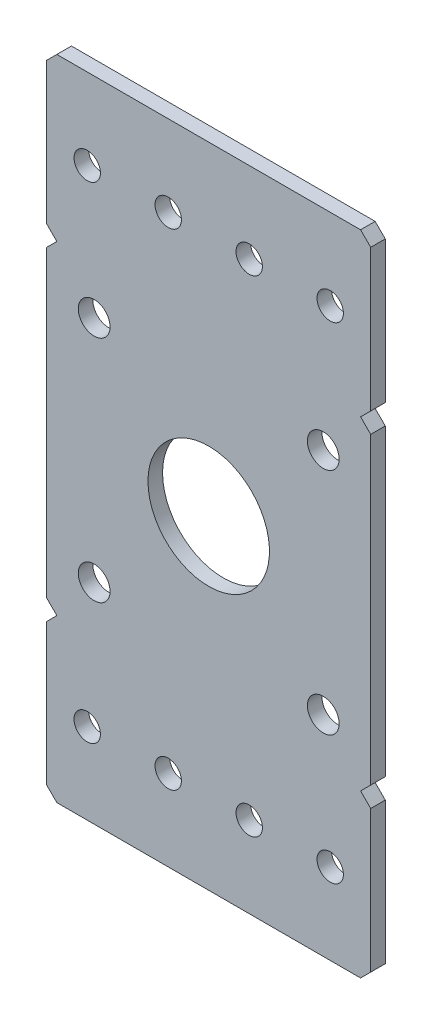
ISO-10303-21;
HEADER;
FILE_DESCRIPTION(('STEP AP214'),'2;1');
FILE_NAME('part.step','',(''),(''),'','','');
FILE_SCHEMA(('AUTOMOTIVE_DESIGN { 1 0 10303 214 1 1 1 1 }'));
ENDSEC;
DATA;
#1=APPLICATION_CONTEXT('core data for automotive mechanical design processes');
#2=APPLICATION_PROTOCOL_DEFINITION('international standard','automotive_design',2000,#1);
#3=PRODUCT_CONTEXT('',#1,'mechanical');
#4=PRODUCT('Part','Part','',(#3));
#5=PRODUCT_RELATED_PRODUCT_CATEGORY('part','',(#4));
#6=PRODUCT_DEFINITION_FORMATION('','',#4);
#7=PRODUCT_DEFINITION_CONTEXT('part definition',#1,'design');
#8=PRODUCT_DEFINITION('design','',#6,#7);
#9=PRODUCT_DEFINITION_SHAPE('','',#8);
#10=(LENGTH_UNIT() NAMED_UNIT(*) SI_UNIT(.MILLI.,.METRE.));
#11=(NAMED_UNIT(*) PLANE_ANGLE_UNIT() SI_UNIT($,.RADIAN.));
#12=(NAMED_UNIT(*) SI_UNIT($,.STERADIAN.) SOLID_ANGLE_UNIT());
#13=UNCERTAINTY_MEASURE_WITH_UNIT(LENGTH_MEASURE(1.E-05),#10,'distance_accuracy_value','');
#14=(GEOMETRIC_REPRESENTATION_CONTEXT(3) GLOBAL_UNCERTAINTY_ASSIGNED_CONTEXT((#13)) GLOBAL_UNIT_ASSIGNED_CONTEXT((#10,
#11,#12)) REPRESENTATION_CONTEXT('',''));
#15=CARTESIAN_POINT('',(0.,0.,0.));
#16=DIRECTION('',(0.,0.,1.));
#17=DIRECTION('',(1.,0.,0.));
#18=AXIS2_PLACEMENT_3D('',#15,#16,#17);
#19=CARTESIAN_POINT('',(25.4,50.8,2.286));
#20=DIRECTION('',(0.,0.,-1.));
#21=DIRECTION('',(-1.,0.,0.));
#22=AXIS2_PLACEMENT_3D('',#19,#20,#21);
#23=PLANE('',#22);
#24=CARTESIAN_POINT('',(-17.9605122421383,-17.9605122421383,2.286));
#25=DIRECTION('',(0.,0.,-1.));
#26=DIRECTION('',(-1.,0.,0.));
#27=AXIS2_PLACEMENT_3D('',#24,#25,#26);
#28=CIRCLE('',#27,2.4892);
#29=CARTESIAN_POINT('',(-20.4497122421383,-17.9605122421383,2.286));
#30=VERTEX_POINT('',#29);
#31=EDGE_CURVE('E216',#30,#30,#28,.T.);
#32=ORIENTED_EDGE('',*,*,#31,.T.);
#33=EDGE_LOOP('',(#32));
#34=FACE_BOUND('',#33,.T.);
#35=CARTESIAN_POINT('',(-19.05,-38.1,2.286));
#36=DIRECTION('',(0.,0.,-1.));
#37=DIRECTION('',(-1.,0.,0.));
#38=AXIS2_PLACEMENT_3D('',#35,#36,#37);
#39=CIRCLE('',#38,2.0701);
#40=CARTESIAN_POINT('',(-21.1201,-38.1,2.286));
#41=VERTEX_POINT('',#40);
#42=EDGE_CURVE('E220',#41,#41,#39,.T.);
#43=ORIENTED_EDGE('',*,*,#42,.T.);
#44=EDGE_LOOP('',(#43));
#45=FACE_BOUND('',#44,.T.);
#46=CARTESIAN_POINT('',(-6.35000000000001,-38.1,2.286));
#47=DIRECTION('',(0.,0.,-1.));
#48=DIRECTION('',(-1.,0.,0.));
#49=AXIS2_PLACEMENT_3D('',#46,#47,#48);
#50=CIRCLE('',#49,2.07009999999999);
#51=CARTESIAN_POINT('',(-8.4201,-38.1,2.286));
#52=VERTEX_POINT('',#51);
#53=EDGE_CURVE('E223',#52,#52,#50,.T.);
#54=ORIENTED_EDGE('',*,*,#53,.T.);
#55=EDGE_LOOP('',(#54));
#56=FACE_BOUND('',#55,.T.);
#57=CARTESIAN_POINT('',(19.05,-38.1,2.286));
#58=DIRECTION('',(0.,0.,-1.));
#59=DIRECTION('',(-1.,0.,0.));
#60=AXIS2_PLACEMENT_3D('',#57,#58,#59);
#61=CIRCLE('',#60,2.07009999999999);
#62=CARTESIAN_POINT('',(16.9799,-38.1,2.286));
#63=VERTEX_POINT('',#62);
#64=EDGE_CURVE('E226',#63,#63,#61,.T.);
#65=ORIENTED_EDGE('',*,*,#64,.T.);
#66=EDGE_LOOP('',(#65));
#67=FACE_BOUND('',#66,.T.);
#68=CARTESIAN_POINT('',(0.,0.,2.286));
#69=DIRECTION('',(0.,0.,-1.));
#70=DIRECTION('',(-1.,0.,0.));
#71=AXIS2_PLACEMENT_3D('',#68,#69,#70);
#72=CIRCLE('',#71,9.525);
#73=CARTESIAN_POINT('',(-9.525,0.,2.286));
#74=VERTEX_POINT('',#73);
#75=EDGE_CURVE('E229',#74,#74,#72,.T.);
#76=ORIENTED_EDGE('',*,*,#75,.T.);
#77=EDGE_LOOP('',(#76));
#78=FACE_BOUND('',#77,.T.);
#79=CARTESIAN_POINT('',(6.34999999999999,38.1,2.286));
#80=DIRECTION('',(0.,0.,-1.));
#81=DIRECTION('',(-1.,0.,0.));
#82=AXIS2_PLACEMENT_3D('',#79,#80,#81);
#83=CIRCLE('',#82,2.07009999999999);
#84=CARTESIAN_POINT('',(4.2799,38.1,2.286));
#85=VERTEX_POINT('',#84);
#86=EDGE_CURVE('E232',#85,#85,#83,.T.);
#87=ORIENTED_EDGE('',*,*,#86,.T.);
#88=EDGE_LOOP('',(#87));
#89=FACE_BOUND('',#88,.T.);
#90=CARTESIAN_POINT('',(-19.05,38.1,2.286));
#91=DIRECTION('',(0.,0.,-1.));
#92=DIRECTION('',(-1.,0.,0.));
#93=AXIS2_PLACEMENT_3D('',#90,#91,#92);
#94=CIRCLE('',#93,2.0701);
#95=CARTESIAN_POINT('',(-21.1201,38.1,2.286));
#96=VERTEX_POINT('',#95);
#97=EDGE_CURVE('E235',#96,#96,#94,.T.);
#98=ORIENTED_EDGE('',*,*,#97,.T.);
#99=EDGE_LOOP('',(#98));
#100=FACE_BOUND('',#99,.T.);
#101=DIRECTION('',(0.707106781186543,-0.707106781186552,0.));
#102=VECTOR('',#101,1.);
#103=CARTESIAN_POINT('',(23.8125,-25.4,2.286));
#104=LINE('',#103,#102);
#105=CARTESIAN_POINT('',(25.4,-26.9875,2.286));
#106=VERTEX_POINT('',#105);
#107=CARTESIAN_POINT('',(23.8125,-25.4,2.286));
#108=VERTEX_POINT('',#107);
#109=EDGE_CURVE('E157',#106,#108,#104,.F.);
#110=ORIENTED_EDGE('',*,*,#109,.T.);
#111=DIRECTION('',(-0.707106781186555,-0.707106781186541,0.));
#112=VECTOR('',#111,1.);
#113=CARTESIAN_POINT('',(25.4,-23.8125,2.286));
#114=LINE('',#113,#112);
#115=CARTESIAN_POINT('',(25.4,-23.8125,2.286));
#116=VERTEX_POINT('',#115);
#117=EDGE_CURVE('E254',#108,#116,#114,.F.);
#118=ORIENTED_EDGE('',*,*,#117,.T.);
#119=DIRECTION('',(0.,1.,0.));
#120=VECTOR('',#119,1.);
#121=CARTESIAN_POINT('',(25.4,25.4,2.286));
#122=LINE('',#121,#120);
#123=CARTESIAN_POINT('',(25.4,23.8125,2.286));
#124=VERTEX_POINT('',#123);
#125=EDGE_CURVE('E264',#116,#124,#122,.T.);
#126=ORIENTED_EDGE('',*,*,#125,.T.);
#127=DIRECTION('',(0.707106781186549,-0.707106781186546,0.));
#128=VECTOR('',#127,1.);
#129=CARTESIAN_POINT('',(23.8125,25.4,2.286));
#130=LINE('',#129,#128);
#131=CARTESIAN_POINT('',(23.8125,25.4,2.286));
#132=VERTEX_POINT('',#131);
#133=EDGE_CURVE('E268',#124,#132,#130,.F.);
#134=ORIENTED_EDGE('',*,*,#133,.T.);
#135=DIRECTION('',(-0.707106781186543,-0.707106781186552,0.));
#136=VECTOR('',#135,1.);
#137=CARTESIAN_POINT('',(25.4,26.9875,2.286));
#138=LINE('',#137,#136);
#139=CARTESIAN_POINT('',(25.4,26.9875,2.286));
#140=VERTEX_POINT('',#139);
#141=EDGE_CURVE('E273',#132,#140,#138,.F.);
#142=ORIENTED_EDGE('',*,*,#141,.T.);
#143=DIRECTION('',(0.,1.,0.));
#144=VECTOR('',#143,1.);
#145=CARTESIAN_POINT('',(25.4,25.4,2.286));
#146=LINE('',#145,#144);
#147=CARTESIAN_POINT('',(25.4,49.2125,2.286));
#148=VERTEX_POINT('',#147);
#149=EDGE_CURVE('E278',#140,#148,#146,.T.);
#150=ORIENTED_EDGE('',*,*,#149,.T.);
#151=DIRECTION('',(0.707106781186548,-0.707106781186547,0.));
#152=VECTOR('',#151,1.);
#153=CARTESIAN_POINT('',(23.8125,50.8,2.286));
#154=LINE('',#153,#152);
#155=CARTESIAN_POINT('',(23.8125,50.8,2.286));
#156=VERTEX_POINT('',#155);
#157=EDGE_CURVE('E283',#148,#156,#154,.F.);
#158=ORIENTED_EDGE('',*,*,#157,.T.);
#159=DIRECTION('',(1.,0.,0.));
#160=VECTOR('',#159,1.);
#161=CARTESIAN_POINT('',(-25.4,50.8,2.286));
#162=LINE('',#161,#160);
#163=CARTESIAN_POINT('',(-23.8125,50.8,2.286));
#164=VERTEX_POINT('',#163);
#165=EDGE_CURVE('E290',#156,#164,#162,.F.);
#166=ORIENTED_EDGE('',*,*,#165,.T.);
#167=DIRECTION('',(0.707106781186548,0.707106781186548,0.));
#168=VECTOR('',#167,1.);
#169=CARTESIAN_POINT('',(-25.4,49.2125,2.286));
#170=LINE('',#169,#168);
#171=CARTESIAN_POINT('',(-25.4,49.2125,2.286));
#172=VERTEX_POINT('',#171);
#173=EDGE_CURVE('E292',#164,#172,#170,.F.);
#174=ORIENTED_EDGE('',*,*,#173,.T.);
#175=DIRECTION('',(0.,1.,0.));
#176=VECTOR('',#175,1.);
#177=CARTESIAN_POINT('',(-25.4,-25.4,2.286));
#178=LINE('',#177,#176);
#179=CARTESIAN_POINT('',(-25.4,26.9875,2.286));
#180=VERTEX_POINT('',#179);
#181=EDGE_CURVE('E299',#172,#180,#178,.F.);
#182=ORIENTED_EDGE('',*,*,#181,.T.);
#183=DIRECTION('',(-0.707106781186552,0.707106781186543,0.));
#184=VECTOR('',#183,1.);
#185=CARTESIAN_POINT('',(-25.4,26.9875,2.286));
#186=LINE('',#185,#184);
#187=CARTESIAN_POINT('',(-23.8125,25.4,2.286));
#188=VERTEX_POINT('',#187);
#189=EDGE_CURVE('E301',#180,#188,#186,.F.);
#190=ORIENTED_EDGE('',*,*,#189,.T.);
#191=DIRECTION('',(0.707106781186544,0.707106781186551,0.));
#192=VECTOR('',#191,1.);
#193=CARTESIAN_POINT('',(-23.8125,25.4,2.286));
#194=LINE('',#193,#192);
#195=CARTESIAN_POINT('',(-25.4,23.8125,2.286));
#196=VERTEX_POINT('',#195);
#197=EDGE_CURVE('E306',#188,#196,#194,.F.);
#198=ORIENTED_EDGE('',*,*,#197,.T.);
#199=DIRECTION('',(0.,1.,0.));
#200=VECTOR('',#199,1.);
#201=CARTESIAN_POINT('',(-25.4,-25.4,2.286));
#202=LINE('',#201,#200);
#203=CARTESIAN_POINT('',(-25.4,-23.8125,2.286));
#204=VERTEX_POINT('',#203);
#205=EDGE_CURVE('E313',#196,#204,#202,.F.);
#206=ORIENTED_EDGE('',*,*,#205,.T.);
#207=DIRECTION('',(-0.707106781186554,0.707106781186541,0.));
#208=VECTOR('',#207,1.);
#209=CARTESIAN_POINT('',(-25.4,-23.8125,2.286));
#210=LINE('',#209,#208);
#211=CARTESIAN_POINT('',(-23.8125,-25.4,2.286));
#212=VERTEX_POINT('',#211);
#213=EDGE_CURVE('E315',#204,#212,#210,.F.);
#214=ORIENTED_EDGE('',*,*,#213,.T.);
#215=DIRECTION('',(0.707106781186541,0.707106781186554,0.));
#216=VECTOR('',#215,1.);
#217=CARTESIAN_POINT('',(-23.8125,-25.4,2.286));
#218=LINE('',#217,#216);
#219=CARTESIAN_POINT('',(-25.4,-26.9875,2.286));
#220=VERTEX_POINT('',#219);
#221=EDGE_CURVE('E320',#212,#220,#218,.F.);
#222=ORIENTED_EDGE('',*,*,#221,.T.);
#223=DIRECTION('',(0.,1.,0.));
#224=VECTOR('',#223,1.);
#225=CARTESIAN_POINT('',(-25.4,-25.4,2.286));
#226=LINE('',#225,#224);
#227=CARTESIAN_POINT('',(-25.4,-49.2125,2.286));
#228=VERTEX_POINT('',#227);
#229=EDGE_CURVE('E325',#220,#228,#226,.F.);
#230=ORIENTED_EDGE('',*,*,#229,.T.);
#231=DIRECTION('',(-0.707106781186548,0.707106781186548,0.));
#232=VECTOR('',#231,1.);
#233=CARTESIAN_POINT('',(-23.8125,-50.8,2.286));
#234=LINE('',#233,#232);
#235=CARTESIAN_POINT('',(-23.8125,-50.8,2.286));
#236=VERTEX_POINT('',#235);
#237=EDGE_CURVE('E330',#228,#236,#234,.F.);
#238=ORIENTED_EDGE('',*,*,#237,.T.);
#239=DIRECTION('',(1.,0.,0.));
#240=VECTOR('',#239,1.);
#241=CARTESIAN_POINT('',(-25.4,-50.8,2.286));
#242=LINE('',#241,#240);
#243=CARTESIAN_POINT('',(23.8125,-50.8,2.286));
#244=VERTEX_POINT('',#243);
#245=EDGE_CURVE('E337',#236,#244,#242,.T.);
#246=ORIENTED_EDGE('',*,*,#245,.T.);
#247=DIRECTION('',(-0.707106781186548,-0.707106781186547,0.));
#248=VECTOR('',#247,1.);
#249=CARTESIAN_POINT('',(25.4,-49.2125,2.286));
#250=LINE('',#249,#248);
#251=CARTESIAN_POINT('',(25.4,-49.2125,2.286));
#252=VERTEX_POINT('',#251);
#253=EDGE_CURVE('E160',#244,#252,#250,.F.);
#254=ORIENTED_EDGE('',*,*,#253,.T.);
#255=DIRECTION('',(0.,1.,0.));
#256=VECTOR('',#255,1.);
#257=CARTESIAN_POINT('',(25.4,25.4,2.286));
#258=LINE('',#257,#256);
#259=EDGE_CURVE('E151',#252,#106,#258,.T.);
#260=ORIENTED_EDGE('',*,*,#259,.T.);
#261=EDGE_LOOP('',(#110,#118,#126,#134,#142,#150,#158,#166,#174,#182,#190,#198,#206,#214,#222,
#230,#238,#246,#254,#260));
#262=FACE_BOUND('',#261,.T.);
#263=CARTESIAN_POINT('',(-6.35000000000001,38.1,2.286));
#264=DIRECTION('',(0.,0.,-1.));
#265=DIRECTION('',(-1.,0.,0.));
#266=AXIS2_PLACEMENT_3D('',#263,#264,#265);
#267=CIRCLE('',#266,2.07009999999999);
#268=CARTESIAN_POINT('',(-8.4201,38.1,2.286));
#269=VERTEX_POINT('',#268);
#270=EDGE_CURVE('E238',#269,#269,#267,.T.);
#271=ORIENTED_EDGE('',*,*,#270,.T.);
#272=EDGE_LOOP('',(#271));
#273=FACE_BOUND('',#272,.T.);
#274=CARTESIAN_POINT('',(19.05,38.1,2.286));
#275=DIRECTION('',(0.,0.,-1.));
#276=DIRECTION('',(-1.,0.,0.));
#277=AXIS2_PLACEMENT_3D('',#274,#275,#276);
#278=CIRCLE('',#277,2.07009999999999);
#279=CARTESIAN_POINT('',(16.9799,38.1,2.286));
#280=VERTEX_POINT('',#279);
#281=EDGE_CURVE('E241',#280,#280,#278,.T.);
#282=ORIENTED_EDGE('',*,*,#281,.T.);
#283=EDGE_LOOP('',(#282));
#284=FACE_BOUND('',#283,.T.);
#285=CARTESIAN_POINT('',(-17.9605122421383,17.9605122421383,2.286));
#286=DIRECTION('',(0.,0.,-1.));
#287=DIRECTION('',(-1.,0.,0.));
#288=AXIS2_PLACEMENT_3D('',#285,#286,#287);
#289=CIRCLE('',#288,2.4892);
#290=CARTESIAN_POINT('',(-20.4497122421383,17.9605122421383,2.286));
#291=VERTEX_POINT('',#290);
#292=EDGE_CURVE('E244',#291,#291,#289,.T.);
#293=ORIENTED_EDGE('',*,*,#292,.T.);
#294=EDGE_LOOP('',(#293));
#295=FACE_BOUND('',#294,.T.);
#296=CARTESIAN_POINT('',(6.34999999999999,-38.1,2.286));
#297=DIRECTION('',(0.,0.,-1.));
#298=DIRECTION('',(-1.,0.,0.));
#299=AXIS2_PLACEMENT_3D('',#296,#297,#298);
#300=CIRCLE('',#299,2.07009999999999);
#301=CARTESIAN_POINT('',(4.2799,-38.1,2.286));
#302=VERTEX_POINT('',#301);
#303=EDGE_CURVE('E247',#302,#302,#300,.T.);
#304=ORIENTED_EDGE('',*,*,#303,.T.);
#305=EDGE_LOOP('',(#304));
#306=FACE_BOUND('',#305,.T.);
#307=CARTESIAN_POINT('',(17.9605122421383,-17.9605122421383,2.286));
#308=DIRECTION('',(0.,0.,-1.));
#309=DIRECTION('',(-1.,0.,0.));
#310=AXIS2_PLACEMENT_3D('',#307,#308,#309);
#311=CIRCLE('',#310,2.4892);
#312=CARTESIAN_POINT('',(15.4713122421383,-17.9605122421383,2.286));
#313=VERTEX_POINT('',#312);
#314=EDGE_CURVE('E249',#313,#313,#311,.T.);
#315=ORIENTED_EDGE('',*,*,#314,.T.);
#316=EDGE_LOOP('',(#315));
#317=FACE_BOUND('',#316,.T.);
#318=CARTESIAN_POINT('',(17.9605122421383,17.9605122421383,2.286));
#319=DIRECTION('',(0.,0.,-1.));
#320=DIRECTION('',(-1.,0.,0.));
#321=AXIS2_PLACEMENT_3D('',#318,#319,#320);
#322=CIRCLE('',#321,2.4892);
#323=CARTESIAN_POINT('',(15.4713122421383,17.9605122421383,2.286));
#324=VERTEX_POINT('',#323);
#325=EDGE_CURVE('E20',#324,#324,#322,.T.);
#326=ORIENTED_EDGE('',*,*,#325,.T.);
#327=EDGE_LOOP('',(#326));
#328=FACE_BOUND('',#327,.T.);
#329=ADVANCED_FACE('F17',(#34,#45,#56,#67,#78,#89,#100,#262,#273,#284,#295,#306,#317,#328),#23,.F.);
#330=CARTESIAN_POINT('',(23.8125,-25.4,0.));
#331=DIRECTION('',(-0.707106781186552,-0.707106781186543,0.));
#332=DIRECTION('',(0.707106781186543,-0.707106781186552,0.));
#333=AXIS2_PLACEMENT_3D('',#330,#331,#332);
#334=PLANE('',#333);
#335=DIRECTION('',(0.,0.,1.));
#336=VECTOR('',#335,1.);
#337=CARTESIAN_POINT('',(25.4,-26.9875,2.286));
#338=LINE('',#337,#336);
#339=CARTESIAN_POINT('',(25.4,-26.9875,0.));
#340=VERTEX_POINT('',#339);
#341=EDGE_CURVE('E162',#106,#340,#338,.F.);
#342=ORIENTED_EDGE('',*,*,#341,.T.);
#343=DIRECTION('',(0.70710678118654,-0.707106781186555,0.));
#344=VECTOR('',#343,1.);
#345=CARTESIAN_POINT('',(23.8125,-25.4,0.));
#346=LINE('',#345,#344);
#347=CARTESIAN_POINT('',(23.8125,-25.4,0.));
#348=VERTEX_POINT('',#347);
#349=EDGE_CURVE('E219',#348,#340,#346,.T.);
#350=ORIENTED_EDGE('',*,*,#349,.F.);
#351=DIRECTION('',(0.,0.,1.));
#352=VECTOR('',#351,1.);
#353=CARTESIAN_POINT('',(23.8125,-25.4,0.));
#354=LINE('',#353,#352);
#355=EDGE_CURVE('E168',#348,#108,#354,.T.);
#356=ORIENTED_EDGE('',*,*,#355,.T.);
#357=ORIENTED_EDGE('',*,*,#109,.F.);
#358=EDGE_LOOP('',(#342,#350,#356,#357));
#359=FACE_BOUND('',#358,.T.);
#360=ADVANCED_FACE('F165',(#359),#334,.F.);
#361=CARTESIAN_POINT('',(25.4,25.4,2.286));
#362=DIRECTION('',(-1.,0.,0.));
#363=DIRECTION('',(0.,0.,1.));
#364=AXIS2_PLACEMENT_3D('',#361,#362,#363);
#365=PLANE('',#364);
#366=ORIENTED_EDGE('',*,*,#341,.F.);
#367=ORIENTED_EDGE('',*,*,#259,.F.);
#368=DIRECTION('',(0.,0.,1.));
#369=VECTOR('',#368,1.);
#370=CARTESIAN_POINT('',(25.4,-49.2125,2.286));
#371=LINE('',#370,#369);
#372=CARTESIAN_POINT('',(25.4,-49.2125,0.));
#373=VERTEX_POINT('',#372);
#374=EDGE_CURVE('E175',#252,#373,#371,.F.);
#375=ORIENTED_EDGE('',*,*,#374,.T.);
#376=DIRECTION('',(0.,1.,0.));
#377=VECTOR('',#376,1.);
#378=CARTESIAN_POINT('',(25.4,50.8,0.));
#379=LINE('',#378,#377);
#380=EDGE_CURVE('E173',#340,#373,#379,.F.);
#381=ORIENTED_EDGE('',*,*,#380,.F.);
#382=EDGE_LOOP('',(#366,#367,#375,#381));
#383=FACE_BOUND('',#382,.T.);
#384=ADVANCED_FACE('F171',(#383),#365,.F.);
#385=CARTESIAN_POINT('',(25.4,-49.2125,2.286));
#386=DIRECTION('',(-0.707106781186547,0.707106781186548,0.));
#387=DIRECTION('',(-0.707106781186548,-0.707106781186547,0.));
#388=AXIS2_PLACEMENT_3D('',#385,#386,#387);
#389=PLANE('',#388);
#390=DIRECTION('',(0.,0.,1.));
#391=VECTOR('',#390,1.);
#392=CARTESIAN_POINT('',(23.8125,-50.8,2.286));
#393=LINE('',#392,#391);
#394=CARTESIAN_POINT('',(23.8125,-50.8,0.));
#395=VERTEX_POINT('',#394);
#396=EDGE_CURVE('E335',#244,#395,#393,.F.);
#397=ORIENTED_EDGE('',*,*,#396,.T.);
#398=DIRECTION('',(-0.707106781186548,-0.707106781186547,0.));
#399=VECTOR('',#398,1.);
#400=CARTESIAN_POINT('',(25.4,-49.2125,0.));
#401=LINE('',#400,#399);
#402=EDGE_CURVE('E353',#373,#395,#401,.T.);
#403=ORIENTED_EDGE('',*,*,#402,.F.);
#404=ORIENTED_EDGE('',*,*,#374,.F.);
#405=ORIENTED_EDGE('',*,*,#253,.F.);
#406=EDGE_LOOP('',(#397,#403,#404,#405));
#407=FACE_BOUND('',#406,.T.);
#408=ADVANCED_FACE('F342',(#407),#389,.F.);
#409=CARTESIAN_POINT('',(-25.4,-50.8,2.286));
#410=DIRECTION('',(0.,1.,0.));
#411=DIRECTION('',(0.,0.,1.));
#412=AXIS2_PLACEMENT_3D('',#409,#410,#411);
#413=PLANE('',#412);
#414=ORIENTED_EDGE('',*,*,#396,.F.);
#415=ORIENTED_EDGE('',*,*,#245,.F.);
#416=DIRECTION('',(0.,0.,1.));
#417=VECTOR('',#416,1.);
#418=CARTESIAN_POINT('',(-23.8125,-50.8,2.286));
#419=LINE('',#418,#417);
#420=CARTESIAN_POINT('',(-23.8125,-50.8,0.));
#421=VERTEX_POINT('',#420);
#422=EDGE_CURVE('E333',#236,#421,#419,.F.);
#423=ORIENTED_EDGE('',*,*,#422,.T.);
#424=DIRECTION('',(-1.,0.,0.));
#425=VECTOR('',#424,1.);
#426=CARTESIAN_POINT('',(25.4,-50.8,0.));
#427=LINE('',#426,#425);
#428=EDGE_CURVE('E347',#395,#421,#427,.T.);
#429=ORIENTED_EDGE('',*,*,#428,.F.);
#430=EDGE_LOOP('',(#414,#415,#423,#429));
#431=FACE_BOUND('',#430,.T.);
#432=ADVANCED_FACE('F345',(#431),#413,.F.);
#433=CARTESIAN_POINT('',(-23.8125,-50.8,2.286));
#434=DIRECTION('',(0.707106781186548,0.707106781186548,0.));
#435=DIRECTION('',(-0.707106781186548,0.707106781186548,0.));
#436=AXIS2_PLACEMENT_3D('',#433,#434,#435);
#437=PLANE('',#436);
#438=DIRECTION('',(0.,0.,-1.));
#439=VECTOR('',#438,1.);
#440=CARTESIAN_POINT('',(-25.4,-49.2125,2.286));
#441=LINE('',#440,#439);
#442=CARTESIAN_POINT('',(-25.4,-49.2125,0.));
#443=VERTEX_POINT('',#442);
#444=EDGE_CURVE('E328',#228,#443,#441,.T.);
#445=ORIENTED_EDGE('',*,*,#444,.T.);
#446=DIRECTION('',(-0.707106781186551,0.707106781186544,0.));
#447=VECTOR('',#446,1.);
#448=CARTESIAN_POINT('',(-23.8125,-50.8,0.));
#449=LINE('',#448,#447);
#450=EDGE_CURVE('E352',#421,#443,#449,.T.);
#451=ORIENTED_EDGE('',*,*,#450,.F.);
#452=ORIENTED_EDGE('',*,*,#422,.F.);
#453=ORIENTED_EDGE('',*,*,#237,.F.);
#454=EDGE_LOOP('',(#445,#451,#452,#453));
#455=FACE_BOUND('',#454,.T.);
#456=ADVANCED_FACE('F689',(#455),#437,.F.);
#457=CARTESIAN_POINT('',(-25.4,-25.4,2.286));
#458=DIRECTION('',(1.,0.,0.));
#459=DIRECTION('',(0.,0.,-1.));
#460=AXIS2_PLACEMENT_3D('',#457,#458,#459);
#461=PLANE('',#460);
#462=DIRECTION('',(0.,0.,1.));
#463=VECTOR('',#462,1.);
#464=CARTESIAN_POINT('',(-25.4,-26.9875,0.));
#465=LINE('',#464,#463);
#466=CARTESIAN_POINT('',(-25.4,-26.9875,0.));
#467=VERTEX_POINT('',#466);
#468=EDGE_CURVE('E323',#220,#467,#465,.F.);
#469=ORIENTED_EDGE('',*,*,#468,.T.);
#470=DIRECTION('',(0.,1.,0.));
#471=VECTOR('',#470,1.);
#472=CARTESIAN_POINT('',(-25.4,50.8,0.));
#473=LINE('',#472,#471);
#474=EDGE_CURVE('E360',#443,#467,#473,.T.);
#475=ORIENTED_EDGE('',*,*,#474,.F.);
#476=ORIENTED_EDGE('',*,*,#444,.F.);
#477=ORIENTED_EDGE('',*,*,#229,.F.);
#478=EDGE_LOOP('',(#469,#475,#476,#477));
#479=FACE_BOUND('',#478,.T.);
#480=ADVANCED_FACE('F680',(#479),#461,.F.);
#481=CARTESIAN_POINT('',(-23.8125,-25.4,0.));
#482=DIRECTION('',(0.707106781186554,-0.707106781186541,0.));
#483=DIRECTION('',(0.707106781186541,0.707106781186554,0.));
#484=AXIS2_PLACEMENT_3D('',#481,#482,#483);
#485=PLANE('',#484);
#486=DIRECTION('',(0.,0.,1.));
#487=VECTOR('',#486,1.);
#488=CARTESIAN_POINT('',(-23.8125,-25.4,0.));
#489=LINE('',#488,#487);
#490=CARTESIAN_POINT('',(-23.8125,-25.4,0.));
#491=VERTEX_POINT('',#490);
#492=EDGE_CURVE('E318',#212,#491,#489,.F.);
#493=ORIENTED_EDGE('',*,*,#492,.T.);
#494=DIRECTION('',(0.707106781186538,0.707106781186557,0.));
#495=VECTOR('',#494,1.);
#496=CARTESIAN_POINT('',(-25.4,-26.9875,0.));
#497=LINE('',#496,#495);
#498=EDGE_CURVE('E363',#467,#491,#497,.T.);
#499=ORIENTED_EDGE('',*,*,#498,.F.);
#500=ORIENTED_EDGE('',*,*,#468,.F.);
#501=ORIENTED_EDGE('',*,*,#221,.F.);
#502=EDGE_LOOP('',(#493,#499,#500,#501));
#503=FACE_BOUND('',#502,.T.);
#504=ADVANCED_FACE('F671',(#503),#485,.F.);
#505=CARTESIAN_POINT('',(-25.4,-23.8125,0.));
#506=DIRECTION('',(0.707106781186541,0.707106781186554,0.));
#507=DIRECTION('',(-0.707106781186554,0.707106781186541,0.));
#508=AXIS2_PLACEMENT_3D('',#505,#506,#507);
#509=PLANE('',#508);
#510=DIRECTION('',(0.,0.,-1.));
#511=VECTOR('',#510,1.);
#512=CARTESIAN_POINT('',(-25.4,-23.8125,2.286));
#513=LINE('',#512,#511);
#514=CARTESIAN_POINT('',(-25.4,-23.8125,0.));
#515=VERTEX_POINT('',#514);
#516=EDGE_CURVE('E311',#204,#515,#513,.T.);
#517=ORIENTED_EDGE('',*,*,#516,.T.);
#518=DIRECTION('',(-0.707106781186554,0.707106781186541,0.));
#519=VECTOR('',#518,1.);
#520=CARTESIAN_POINT('',(-23.8125,-25.4,0.));
#521=LINE('',#520,#519);
#522=EDGE_CURVE('E366',#491,#515,#521,.T.);
#523=ORIENTED_EDGE('',*,*,#522,.F.);
#524=ORIENTED_EDGE('',*,*,#492,.F.);
#525=ORIENTED_EDGE('',*,*,#213,.F.);
#526=EDGE_LOOP('',(#517,#523,#524,#525));
#527=FACE_BOUND('',#526,.T.);
#528=ADVANCED_FACE('F662',(#527),#509,.F.);
#529=CARTESIAN_POINT('',(-25.4,-25.4,2.286));
#530=DIRECTION('',(1.,0.,0.));
#531=DIRECTION('',(0.,0.,-1.));
#532=AXIS2_PLACEMENT_3D('',#529,#530,#531);
#533=PLANE('',#532);
#534=ORIENTED_EDGE('',*,*,#516,.F.);
#535=ORIENTED_EDGE('',*,*,#205,.F.);
#536=DIRECTION('',(0.,0.,1.));
#537=VECTOR('',#536,1.);
#538=CARTESIAN_POINT('',(-25.4,23.8125,0.));
#539=LINE('',#538,#537);
#540=CARTESIAN_POINT('',(-25.4,23.8125,0.));
#541=VERTEX_POINT('',#540);
#542=EDGE_CURVE('E309',#196,#541,#539,.F.);
#543=ORIENTED_EDGE('',*,*,#542,.T.);
#544=DIRECTION('',(0.,1.,0.));
#545=VECTOR('',#544,1.);
#546=CARTESIAN_POINT('',(-25.4,50.8,0.));
#547=LINE('',#546,#545);
#548=EDGE_CURVE('E369',#515,#541,#547,.T.);
#549=ORIENTED_EDGE('',*,*,#548,.F.);
#550=EDGE_LOOP('',(#534,#535,#543,#549));
#551=FACE_BOUND('',#550,.T.);
#552=ADVANCED_FACE('F653',(#551),#533,.F.);
#553=CARTESIAN_POINT('',(-23.8125,25.4,0.));
#554=DIRECTION('',(0.707106781186551,-0.707106781186544,0.));
#555=DIRECTION('',(0.707106781186544,0.707106781186551,0.));
#556=AXIS2_PLACEMENT_3D('',#553,#554,#555);
#557=PLANE('',#556);
#558=DIRECTION('',(0.,0.,1.));
#559=VECTOR('',#558,1.);
#560=CARTESIAN_POINT('',(-23.8125,25.4,0.));
#561=LINE('',#560,#559);
#562=CARTESIAN_POINT('',(-23.8125,25.4,0.));
#563=VERTEX_POINT('',#562);
#564=EDGE_CURVE('E304',#188,#563,#561,.F.);
#565=ORIENTED_EDGE('',*,*,#564,.T.);
#566=DIRECTION('',(0.707106781186541,0.707106781186554,0.));
#567=VECTOR('',#566,1.);
#568=CARTESIAN_POINT('',(-25.4,23.8125,0.));
#569=LINE('',#568,#567);
#570=EDGE_CURVE('E372',#541,#563,#569,.T.);
#571=ORIENTED_EDGE('',*,*,#570,.F.);
#572=ORIENTED_EDGE('',*,*,#542,.F.);
#573=ORIENTED_EDGE('',*,*,#197,.F.);
#574=EDGE_LOOP('',(#565,#571,#572,#573));
#575=FACE_BOUND('',#574,.T.);
#576=ADVANCED_FACE('F644',(#575),#557,.F.);
#577=CARTESIAN_POINT('',(-25.4,26.9875,0.));
#578=DIRECTION('',(0.707106781186543,0.707106781186552,0.));
#579=DIRECTION('',(-0.707106781186552,0.707106781186543,0.));
#580=AXIS2_PLACEMENT_3D('',#577,#578,#579);
#581=PLANE('',#580);
#582=DIRECTION('',(0.,0.,-1.));
#583=VECTOR('',#582,1.);
#584=CARTESIAN_POINT('',(-25.4,26.9875,2.286));
#585=LINE('',#584,#583);
#586=CARTESIAN_POINT('',(-25.4,26.9875,0.));
#587=VERTEX_POINT('',#586);
#588=EDGE_CURVE('E297',#180,#587,#585,.T.);
#589=ORIENTED_EDGE('',*,*,#588,.T.);
#590=DIRECTION('',(-0.707106781186551,0.707106781186544,0.));
#591=VECTOR('',#590,1.);
#592=CARTESIAN_POINT('',(-23.8125,25.4,0.));
#593=LINE('',#592,#591);
#594=EDGE_CURVE('E375',#563,#587,#593,.T.);
#595=ORIENTED_EDGE('',*,*,#594,.F.);
#596=ORIENTED_EDGE('',*,*,#564,.F.);
#597=ORIENTED_EDGE('',*,*,#189,.F.);
#598=EDGE_LOOP('',(#589,#595,#596,#597));
#599=FACE_BOUND('',#598,.T.);
#600=ADVANCED_FACE('F635',(#599),#581,.F.);
#601=CARTESIAN_POINT('',(-25.4,-25.4,2.286));
#602=DIRECTION('',(1.,0.,0.));
#603=DIRECTION('',(0.,0.,-1.));
#604=AXIS2_PLACEMENT_3D('',#601,#602,#603);
#605=PLANE('',#604);
#606=ORIENTED_EDGE('',*,*,#588,.F.);
#607=ORIENTED_EDGE('',*,*,#181,.F.);
#608=DIRECTION('',(0.,0.,1.));
#609=VECTOR('',#608,1.);
#610=CARTESIAN_POINT('',(-25.4,49.2125,2.286));
#611=LINE('',#610,#609);
#612=CARTESIAN_POINT('',(-25.4,49.2125,0.));
#613=VERTEX_POINT('',#612);
#614=EDGE_CURVE('E295',#172,#613,#611,.F.);
#615=ORIENTED_EDGE('',*,*,#614,.T.);
#616=DIRECTION('',(0.,1.,0.));
#617=VECTOR('',#616,1.);
#618=CARTESIAN_POINT('',(-25.4,50.8,0.));
#619=LINE('',#618,#617);
#620=EDGE_CURVE('E378',#587,#613,#619,.T.);
#621=ORIENTED_EDGE('',*,*,#620,.F.);
#622=EDGE_LOOP('',(#606,#607,#615,#621));
#623=FACE_BOUND('',#622,.T.);
#624=ADVANCED_FACE('F626',(#623),#605,.F.);
#625=CARTESIAN_POINT('',(-25.4,49.2125,2.286));
#626=DIRECTION('',(0.707106781186548,-0.707106781186548,0.));
#627=DIRECTION('',(0.707106781186548,0.707106781186548,0.));
#628=AXIS2_PLACEMENT_3D('',#625,#626,#627);
#629=PLANE('',#628);
#630=DIRECTION('',(0.,0.,-1.));
#631=VECTOR('',#630,1.);
#632=CARTESIAN_POINT('',(-23.8125,50.8,2.286));
#633=LINE('',#632,#631);
#634=CARTESIAN_POINT('',(-23.8125,50.8,0.));
#635=VERTEX_POINT('',#634);
#636=EDGE_CURVE('E288',#164,#635,#633,.T.);
#637=ORIENTED_EDGE('',*,*,#636,.T.);
#638=DIRECTION('',(0.707106781186541,0.707106781186554,0.));
#639=VECTOR('',#638,1.);
#640=CARTESIAN_POINT('',(-25.4,49.2125,0.));
#641=LINE('',#640,#639);
#642=EDGE_CURVE('E381',#613,#635,#641,.T.);
#643=ORIENTED_EDGE('',*,*,#642,.F.);
#644=ORIENTED_EDGE('',*,*,#614,.F.);
#645=ORIENTED_EDGE('',*,*,#173,.F.);
#646=EDGE_LOOP('',(#637,#643,#644,#645));
#647=FACE_BOUND('',#646,.T.);
#648=ADVANCED_FACE('F617',(#647),#629,.F.);
#649=CARTESIAN_POINT('',(-25.4,50.8,2.286));
#650=DIRECTION('',(0.,-1.,0.));
#651=DIRECTION('',(0.,0.,-1.));
#652=AXIS2_PLACEMENT_3D('',#649,#650,#651);
#653=PLANE('',#652);
#654=ORIENTED_EDGE('',*,*,#636,.F.);
#655=ORIENTED_EDGE('',*,*,#165,.F.);
#656=DIRECTION('',(0.,0.,1.));
#657=VECTOR('',#656,1.);
#658=CARTESIAN_POINT('',(23.8125,50.8,2.286));
#659=LINE('',#658,#657);
#660=CARTESIAN_POINT('',(23.8125,50.8,0.));
#661=VERTEX_POINT('',#660);
#662=EDGE_CURVE('E286',#156,#661,#659,.F.);
#663=ORIENTED_EDGE('',*,*,#662,.T.);
#664=DIRECTION('',(-1.,0.,0.));
#665=VECTOR('',#664,1.);
#666=CARTESIAN_POINT('',(25.4,50.8,0.));
#667=LINE('',#666,#665);
#668=EDGE_CURVE('E384',#635,#661,#667,.F.);
#669=ORIENTED_EDGE('',*,*,#668,.F.);
#670=EDGE_LOOP('',(#654,#655,#663,#669));
#671=FACE_BOUND('',#670,.T.);
#672=ADVANCED_FACE('F608',(#671),#653,.F.);
#673=CARTESIAN_POINT('',(23.8125,50.8,2.286));
#674=DIRECTION('',(-0.707106781186547,-0.707106781186548,0.));
#675=DIRECTION('',(0.707106781186548,-0.707106781186547,0.));
#676=AXIS2_PLACEMENT_3D('',#673,#674,#675);
#677=PLANE('',#676);
#678=DIRECTION('',(0.,0.,1.));
#679=VECTOR('',#678,1.);
#680=CARTESIAN_POINT('',(25.4,49.2125,2.286));
#681=LINE('',#680,#679);
#682=CARTESIAN_POINT('',(25.4,49.2125,0.));
#683=VERTEX_POINT('',#682);
#684=EDGE_CURVE('E281',#148,#683,#681,.F.);
#685=ORIENTED_EDGE('',*,*,#684,.T.);
#686=DIRECTION('',(0.707106781186551,-0.707106781186544,0.));
#687=VECTOR('',#686,1.);
#688=CARTESIAN_POINT('',(23.8125,50.8,0.));
#689=LINE('',#688,#687);
#690=EDGE_CURVE('E387',#661,#683,#689,.T.);
#691=ORIENTED_EDGE('',*,*,#690,.F.);
#692=ORIENTED_EDGE('',*,*,#662,.F.);
#693=ORIENTED_EDGE('',*,*,#157,.F.);
#694=EDGE_LOOP('',(#685,#691,#692,#693));
#695=FACE_BOUND('',#694,.T.);
#696=ADVANCED_FACE('F599',(#695),#677,.F.);
#697=CARTESIAN_POINT('',(25.4,25.4,2.286));
#698=DIRECTION('',(-1.,0.,0.));
#699=DIRECTION('',(0.,0.,1.));
#700=AXIS2_PLACEMENT_3D('',#697,#698,#699);
#701=PLANE('',#700);
#702=DIRECTION('',(0.,0.,1.));
#703=VECTOR('',#702,1.);
#704=CARTESIAN_POINT('',(25.4,26.9875,0.));
#705=LINE('',#704,#703);
#706=CARTESIAN_POINT('',(25.4,26.9875,0.));
#707=VERTEX_POINT('',#706);
#708=EDGE_CURVE('E276',#140,#707,#705,.F.);
#709=ORIENTED_EDGE('',*,*,#708,.T.);
#710=DIRECTION('',(0.,1.,0.));
#711=VECTOR('',#710,1.);
#712=CARTESIAN_POINT('',(25.4,50.8,0.));
#713=LINE('',#712,#711);
#714=EDGE_CURVE('E390',#683,#707,#713,.F.);
#715=ORIENTED_EDGE('',*,*,#714,.F.);
#716=ORIENTED_EDGE('',*,*,#684,.F.);
#717=ORIENTED_EDGE('',*,*,#149,.F.);
#718=EDGE_LOOP('',(#709,#715,#716,#717));
#719=FACE_BOUND('',#718,.T.);
#720=ADVANCED_FACE('F590',(#719),#701,.F.);
#721=CARTESIAN_POINT('',(25.4,26.9875,0.));
#722=DIRECTION('',(-0.707106781186552,0.707106781186543,0.));
#723=DIRECTION('',(-0.707106781186543,-0.707106781186552,0.));
#724=AXIS2_PLACEMENT_3D('',#721,#722,#723);
#725=PLANE('',#724);
#726=DIRECTION('',(0.,0.,1.));
#727=VECTOR('',#726,1.);
#728=CARTESIAN_POINT('',(23.8125,25.4,0.));
#729=LINE('',#728,#727);
#730=CARTESIAN_POINT('',(23.8125,25.4,0.));
#731=VERTEX_POINT('',#730);
#732=EDGE_CURVE('E271',#132,#731,#729,.F.);
#733=ORIENTED_EDGE('',*,*,#732,.T.);
#734=DIRECTION('',(-0.707106781186544,-0.707106781186551,0.));
#735=VECTOR('',#734,1.);
#736=CARTESIAN_POINT('',(25.4,26.9875,0.));
#737=LINE('',#736,#735);
#738=EDGE_CURVE('E393',#707,#731,#737,.T.);
#739=ORIENTED_EDGE('',*,*,#738,.F.);
#740=ORIENTED_EDGE('',*,*,#708,.F.);
#741=ORIENTED_EDGE('',*,*,#141,.F.);
#742=EDGE_LOOP('',(#733,#739,#740,#741));
#743=FACE_BOUND('',#742,.T.);
#744=ADVANCED_FACE('F581',(#743),#725,.F.);
#745=CARTESIAN_POINT('',(23.8125,25.4,0.));
#746=DIRECTION('',(-0.707106781186546,-0.707106781186549,0.));
#747=DIRECTION('',(0.707106781186549,-0.707106781186546,0.));
#748=AXIS2_PLACEMENT_3D('',#745,#746,#747);
#749=PLANE('',#748);
#750=DIRECTION('',(0.,0.,1.));
#751=VECTOR('',#750,1.);
#752=CARTESIAN_POINT('',(25.4,23.8125,2.286));
#753=LINE('',#752,#751);
#754=CARTESIAN_POINT('',(25.4,23.8125,0.));
#755=VERTEX_POINT('',#754);
#756=EDGE_CURVE('E266',#124,#755,#753,.F.);
#757=ORIENTED_EDGE('',*,*,#756,.T.);
#758=DIRECTION('',(0.707106781186549,-0.707106781186546,0.));
#759=VECTOR('',#758,1.);
#760=CARTESIAN_POINT('',(23.8125,25.4,0.));
#761=LINE('',#760,#759);
#762=EDGE_CURVE('E396',#731,#755,#761,.T.);
#763=ORIENTED_EDGE('',*,*,#762,.F.);
#764=ORIENTED_EDGE('',*,*,#732,.F.);
#765=ORIENTED_EDGE('',*,*,#133,.F.);
#766=EDGE_LOOP('',(#757,#763,#764,#765));
#767=FACE_BOUND('',#766,.T.);
#768=ADVANCED_FACE('F416',(#767),#749,.F.);
#769=CARTESIAN_POINT('',(25.4,25.4,2.286));
#770=DIRECTION('',(-1.,0.,0.));
#771=DIRECTION('',(0.,0.,1.));
#772=AXIS2_PLACEMENT_3D('',#769,#770,#771);
#773=PLANE('',#772);
#774=DIRECTION('',(0.,0.,1.));
#775=VECTOR('',#774,1.);
#776=CARTESIAN_POINT('',(25.4,-23.8125,0.));
#777=LINE('',#776,#775);
#778=CARTESIAN_POINT('',(25.4,-23.8125,0.));
#779=VERTEX_POINT('',#778);
#780=EDGE_CURVE('E35',#116,#779,#777,.F.);
#781=ORIENTED_EDGE('',*,*,#780,.T.);
#782=DIRECTION('',(0.,1.,0.));
#783=VECTOR('',#782,1.);
#784=CARTESIAN_POINT('',(25.4,50.8,0.));
#785=LINE('',#784,#783);
#786=EDGE_CURVE('E399',#755,#779,#785,.F.);
#787=ORIENTED_EDGE('',*,*,#786,.F.);
#788=ORIENTED_EDGE('',*,*,#756,.F.);
#789=ORIENTED_EDGE('',*,*,#125,.F.);
#790=EDGE_LOOP('',(#781,#787,#788,#789));
#791=FACE_BOUND('',#790,.T.);
#792=ADVANCED_FACE('F406',(#791),#773,.F.);
#793=CARTESIAN_POINT('',(25.4,-23.8125,0.));
#794=DIRECTION('',(-0.707106781186541,0.707106781186555,0.));
#795=DIRECTION('',(-0.707106781186555,-0.707106781186541,0.));
#796=AXIS2_PLACEMENT_3D('',#793,#794,#795);
#797=PLANE('',#796);
#798=ORIENTED_EDGE('',*,*,#355,.F.);
#799=DIRECTION('',(-0.707106781186555,-0.70710678118654,0.));
#800=VECTOR('',#799,1.);
#801=CARTESIAN_POINT('',(25.4,-23.8125,0.));
#802=LINE('',#801,#800);
#803=EDGE_CURVE('E215',#779,#348,#802,.T.);
#804=ORIENTED_EDGE('',*,*,#803,.F.);
#805=ORIENTED_EDGE('',*,*,#780,.F.);
#806=ORIENTED_EDGE('',*,*,#117,.F.);
#807=EDGE_LOOP('',(#798,#804,#805,#806));
#808=FACE_BOUND('',#807,.T.);
#809=ADVANCED_FACE('F403',(#808),#797,.F.);
#810=CARTESIAN_POINT('',(17.9605122421383,17.9605122421383,2.286));
#811=DIRECTION('',(0.,0.,-1.));
#812=DIRECTION('',(-1.,0.,0.));
#813=AXIS2_PLACEMENT_3D('',#810,#811,#812);
#814=CYLINDRICAL_SURFACE('',#813,2.4892);
#815=ORIENTED_EDGE('',*,*,#325,.F.);
#816=EDGE_LOOP('',(#815));
#817=FACE_BOUND('',#816,.T.);
#818=CARTESIAN_POINT('',(17.9605122421383,17.9605122421383,0.));
#819=DIRECTION('',(0.,0.,-1.));
#820=DIRECTION('',(-1.,0.,0.));
#821=AXIS2_PLACEMENT_3D('',#818,#819,#820);
#822=CIRCLE('',#821,2.4892);
#823=CARTESIAN_POINT('',(15.4713122421383,17.9605122421383,0.));
#824=VERTEX_POINT('',#823);
#825=EDGE_CURVE('E212',#824,#824,#822,.F.);
#826=ORIENTED_EDGE('',*,*,#825,.F.);
#827=EDGE_LOOP('',(#826));
#828=FACE_BOUND('',#827,.T.);
#829=ADVANCED_FACE('F405',(#817,#828),#814,.F.);
#830=CARTESIAN_POINT('',(17.9605122421383,-17.9605122421383,2.286));
#831=DIRECTION('',(0.,0.,-1.));
#832=DIRECTION('',(-1.,0.,0.));
#833=AXIS2_PLACEMENT_3D('',#830,#831,#832);
#834=CYLINDRICAL_SURFACE('',#833,2.4892);
#835=ORIENTED_EDGE('',*,*,#314,.F.);
#836=EDGE_LOOP('',(#835));
#837=FACE_BOUND('',#836,.T.);
#838=CARTESIAN_POINT('',(17.9605122421383,-17.9605122421383,0.));
#839=DIRECTION('',(0.,0.,-1.));
#840=DIRECTION('',(-1.,0.,0.));
#841=AXIS2_PLACEMENT_3D('',#838,#839,#840);
#842=CIRCLE('',#841,2.4892);
#843=CARTESIAN_POINT('',(15.4713122421383,-17.9605122421383,0.));
#844=VERTEX_POINT('',#843);
#845=EDGE_CURVE('E209',#844,#844,#842,.F.);
#846=ORIENTED_EDGE('',*,*,#845,.F.);
#847=EDGE_LOOP('',(#846));
#848=FACE_BOUND('',#847,.T.);
#849=ADVANCED_FACE('F413',(#837,#848),#834,.F.);
#850=CARTESIAN_POINT('',(6.34999999999999,-38.1,2.286));
#851=DIRECTION('',(0.,0.,-1.));
#852=DIRECTION('',(-1.,0.,0.));
#853=AXIS2_PLACEMENT_3D('',#850,#851,#852);
#854=CYLINDRICAL_SURFACE('',#853,2.07009999999999);
#855=ORIENTED_EDGE('',*,*,#303,.F.);
#856=EDGE_LOOP('',(#855));
#857=FACE_BOUND('',#856,.T.);
#858=CARTESIAN_POINT('',(6.34999999999999,-38.1,0.));
#859=DIRECTION('',(0.,0.,-1.));
#860=DIRECTION('',(-1.,0.,0.));
#861=AXIS2_PLACEMENT_3D('',#858,#859,#860);
#862=CIRCLE('',#861,2.07009999999999);
#863=CARTESIAN_POINT('',(4.2799,-38.1,0.));
#864=VERTEX_POINT('',#863);
#865=EDGE_CURVE('E206',#864,#864,#862,.F.);
#866=ORIENTED_EDGE('',*,*,#865,.F.);
#867=EDGE_LOOP('',(#866));
#868=FACE_BOUND('',#867,.T.);
#869=ADVANCED_FACE('F464',(#857,#868),#854,.F.);
#870=CARTESIAN_POINT('',(-17.9605122421383,17.9605122421383,2.286));
#871=DIRECTION('',(0.,0.,-1.));
#872=DIRECTION('',(-1.,0.,0.));
#873=AXIS2_PLACEMENT_3D('',#870,#871,#872);
#874=CYLINDRICAL_SURFACE('',#873,2.4892);
#875=ORIENTED_EDGE('',*,*,#292,.F.);
#876=EDGE_LOOP('',(#875));
#877=FACE_BOUND('',#876,.T.);
#878=CARTESIAN_POINT('',(-17.9605122421383,17.9605122421383,0.));
#879=DIRECTION('',(0.,0.,-1.));
#880=DIRECTION('',(-1.,0.,0.));
#881=AXIS2_PLACEMENT_3D('',#878,#879,#880);
#882=CIRCLE('',#881,2.4892);
#883=CARTESIAN_POINT('',(-20.4497122421383,17.9605122421383,0.));
#884=VERTEX_POINT('',#883);
#885=EDGE_CURVE('E203',#884,#884,#882,.F.);
#886=ORIENTED_EDGE('',*,*,#885,.F.);
#887=EDGE_LOOP('',(#886));
#888=FACE_BOUND('',#887,.T.);
#889=ADVANCED_FACE('F460',(#877,#888),#874,.F.);
#890=CARTESIAN_POINT('',(19.05,38.1,2.286));
#891=DIRECTION('',(0.,0.,-1.));
#892=DIRECTION('',(-1.,0.,0.));
#893=AXIS2_PLACEMENT_3D('',#890,#891,#892);
#894=CYLINDRICAL_SURFACE('',#893,2.07009999999999);
#895=ORIENTED_EDGE('',*,*,#281,.F.);
#896=EDGE_LOOP('',(#895));
#897=FACE_BOUND('',#896,.T.);
#898=CARTESIAN_POINT('',(19.05,38.1,0.));
#899=DIRECTION('',(0.,0.,-1.));
#900=DIRECTION('',(-1.,0.,0.));
#901=AXIS2_PLACEMENT_3D('',#898,#899,#900);
#902=CIRCLE('',#901,2.07009999999999);
#903=CARTESIAN_POINT('',(16.9799,38.1,0.));
#904=VERTEX_POINT('',#903);
#905=EDGE_CURVE('E200',#904,#904,#902,.F.);
#906=ORIENTED_EDGE('',*,*,#905,.F.);
#907=EDGE_LOOP('',(#906));
#908=FACE_BOUND('',#907,.T.);
#909=ADVANCED_FACE('F456',(#897,#908),#894,.F.);
#910=CARTESIAN_POINT('',(-6.35000000000001,38.1,2.286));
#911=DIRECTION('',(0.,0.,-1.));
#912=DIRECTION('',(-1.,0.,0.));
#913=AXIS2_PLACEMENT_3D('',#910,#911,#912);
#914=CYLINDRICAL_SURFACE('',#913,2.07009999999999);
#915=ORIENTED_EDGE('',*,*,#270,.F.);
#916=EDGE_LOOP('',(#915));
#917=FACE_BOUND('',#916,.T.);
#918=CARTESIAN_POINT('',(-6.35000000000001,38.1,0.));
#919=DIRECTION('',(0.,0.,-1.));
#920=DIRECTION('',(-1.,0.,0.));
#921=AXIS2_PLACEMENT_3D('',#918,#919,#920);
#922=CIRCLE('',#921,2.07009999999999);
#923=CARTESIAN_POINT('',(-8.4201,38.1,0.));
#924=VERTEX_POINT('',#923);
#925=EDGE_CURVE('E197',#924,#924,#922,.F.);
#926=ORIENTED_EDGE('',*,*,#925,.F.);
#927=EDGE_LOOP('',(#926));
#928=FACE_BOUND('',#927,.T.);
#929=ADVANCED_FACE('F452',(#917,#928),#914,.F.);
#930=CARTESIAN_POINT('',(-19.05,38.1,2.286));
#931=DIRECTION('',(0.,0.,-1.));
#932=DIRECTION('',(-1.,0.,0.));
#933=AXIS2_PLACEMENT_3D('',#930,#931,#932);
#934=CYLINDRICAL_SURFACE('',#933,2.0701);
#935=ORIENTED_EDGE('',*,*,#97,.F.);
#936=EDGE_LOOP('',(#935));
#937=FACE_BOUND('',#936,.T.);
#938=CARTESIAN_POINT('',(-19.05,38.1,0.));
#939=DIRECTION('',(0.,0.,-1.));
#940=DIRECTION('',(-1.,0.,0.));
#941=AXIS2_PLACEMENT_3D('',#938,#939,#940);
#942=CIRCLE('',#941,2.0701);
#943=CARTESIAN_POINT('',(-21.1201,38.1,0.));
#944=VERTEX_POINT('',#943);
#945=EDGE_CURVE('E194',#944,#944,#942,.F.);
#946=ORIENTED_EDGE('',*,*,#945,.F.);
#947=EDGE_LOOP('',(#946));
#948=FACE_BOUND('',#947,.T.);
#949=ADVANCED_FACE('F448',(#937,#948),#934,.F.);
#950=CARTESIAN_POINT('',(6.34999999999999,38.1,2.286));
#951=DIRECTION('',(0.,0.,-1.));
#952=DIRECTION('',(-1.,0.,0.));
#953=AXIS2_PLACEMENT_3D('',#950,#951,#952);
#954=CYLINDRICAL_SURFACE('',#953,2.07009999999999);
#955=ORIENTED_EDGE('',*,*,#86,.F.);
#956=EDGE_LOOP('',(#955));
#957=FACE_BOUND('',#956,.T.);
#958=CARTESIAN_POINT('',(6.34999999999999,38.1,0.));
#959=DIRECTION('',(0.,0.,-1.));
#960=DIRECTION('',(-1.,0.,0.));
#961=AXIS2_PLACEMENT_3D('',#958,#959,#960);
#962=CIRCLE('',#961,2.07009999999999);
#963=CARTESIAN_POINT('',(4.2799,38.1,0.));
#964=VERTEX_POINT('',#963);
#965=EDGE_CURVE('E191',#964,#964,#962,.F.);
#966=ORIENTED_EDGE('',*,*,#965,.F.);
#967=EDGE_LOOP('',(#966));
#968=FACE_BOUND('',#967,.T.);
#969=ADVANCED_FACE('F444',(#957,#968),#954,.F.);
#970=CARTESIAN_POINT('',(0.,0.,2.286));
#971=DIRECTION('',(0.,0.,-1.));
#972=DIRECTION('',(-1.,0.,0.));
#973=AXIS2_PLACEMENT_3D('',#970,#971,#972);
#974=CYLINDRICAL_SURFACE('',#973,9.525);
#975=ORIENTED_EDGE('',*,*,#75,.F.);
#976=EDGE_LOOP('',(#975));
#977=FACE_BOUND('',#976,.T.);
#978=CARTESIAN_POINT('',(0.,0.,0.));
#979=DIRECTION('',(0.,0.,-1.));
#980=DIRECTION('',(-1.,0.,0.));
#981=AXIS2_PLACEMENT_3D('',#978,#979,#980);
#982=CIRCLE('',#981,9.525);
#983=CARTESIAN_POINT('',(-9.525,0.,0.));
#984=VERTEX_POINT('',#983);
#985=EDGE_CURVE('E188',#984,#984,#982,.F.);
#986=ORIENTED_EDGE('',*,*,#985,.F.);
#987=EDGE_LOOP('',(#986));
#988=FACE_BOUND('',#987,.T.);
#989=ADVANCED_FACE('F440',(#977,#988),#974,.F.);
#990=CARTESIAN_POINT('',(19.05,-38.1,2.286));
#991=DIRECTION('',(0.,0.,-1.));
#992=DIRECTION('',(-1.,0.,0.));
#993=AXIS2_PLACEMENT_3D('',#990,#991,#992);
#994=CYLINDRICAL_SURFACE('',#993,2.07009999999999);
#995=ORIENTED_EDGE('',*,*,#64,.F.);
#996=EDGE_LOOP('',(#995));
#997=FACE_BOUND('',#996,.T.);
#998=CARTESIAN_POINT('',(19.05,-38.1,0.));
#999=DIRECTION('',(0.,0.,-1.));
#1000=DIRECTION('',(-1.,0.,0.));
#1001=AXIS2_PLACEMENT_3D('',#998,#999,#1000);
#1002=CIRCLE('',#1001,2.07009999999999);
#1003=CARTESIAN_POINT('',(16.9799,-38.1,0.));
#1004=VERTEX_POINT('',#1003);
#1005=EDGE_CURVE('E185',#1004,#1004,#1002,.F.);
#1006=ORIENTED_EDGE('',*,*,#1005,.F.);
#1007=EDGE_LOOP('',(#1006));
#1008=FACE_BOUND('',#1007,.T.);
#1009=ADVANCED_FACE('F436',(#997,#1008),#994,.F.);
#1010=CARTESIAN_POINT('',(-6.35000000000001,-38.1,2.286));
#1011=DIRECTION('',(0.,0.,-1.));
#1012=DIRECTION('',(-1.,0.,0.));
#1013=AXIS2_PLACEMENT_3D('',#1010,#1011,#1012);
#1014=CYLINDRICAL_SURFACE('',#1013,2.07009999999999);
#1015=ORIENTED_EDGE('',*,*,#53,.F.);
#1016=EDGE_LOOP('',(#1015));
#1017=FACE_BOUND('',#1016,.T.);
#1018=CARTESIAN_POINT('',(-6.35000000000001,-38.1,0.));
#1019=DIRECTION('',(0.,0.,-1.));
#1020=DIRECTION('',(-1.,0.,0.));
#1021=AXIS2_PLACEMENT_3D('',#1018,#1019,#1020);
#1022=CIRCLE('',#1021,2.07009999999999);
#1023=CARTESIAN_POINT('',(-8.4201,-38.1,0.));
#1024=VERTEX_POINT('',#1023);
#1025=EDGE_CURVE('E182',#1024,#1024,#1022,.F.);
#1026=ORIENTED_EDGE('',*,*,#1025,.F.);
#1027=EDGE_LOOP('',(#1026));
#1028=FACE_BOUND('',#1027,.T.);
#1029=ADVANCED_FACE('F432',(#1017,#1028),#1014,.F.);
#1030=CARTESIAN_POINT('',(-19.05,-38.1,2.286));
#1031=DIRECTION('',(0.,0.,-1.));
#1032=DIRECTION('',(-1.,0.,0.));
#1033=AXIS2_PLACEMENT_3D('',#1030,#1031,#1032);
#1034=CYLINDRICAL_SURFACE('',#1033,2.0701);
#1035=ORIENTED_EDGE('',*,*,#42,.F.);
#1036=EDGE_LOOP('',(#1035));
#1037=FACE_BOUND('',#1036,.T.);
#1038=CARTESIAN_POINT('',(-19.05,-38.1,0.));
#1039=DIRECTION('',(0.,0.,-1.));
#1040=DIRECTION('',(-1.,0.,0.));
#1041=AXIS2_PLACEMENT_3D('',#1038,#1039,#1040);
#1042=CIRCLE('',#1041,2.0701);
#1043=CARTESIAN_POINT('',(-21.1201,-38.1,0.));
#1044=VERTEX_POINT('',#1043);
#1045=EDGE_CURVE('E26',#1044,#1044,#1042,.F.);
#1046=ORIENTED_EDGE('',*,*,#1045,.F.);
#1047=EDGE_LOOP('',(#1046));
#1048=FACE_BOUND('',#1047,.T.);
#1049=ADVANCED_FACE('F425',(#1037,#1048),#1034,.F.);
#1050=CARTESIAN_POINT('',(-17.9605122421383,-17.9605122421383,2.286));
#1051=DIRECTION('',(0.,0.,-1.));
#1052=DIRECTION('',(-1.,0.,0.));
#1053=AXIS2_PLACEMENT_3D('',#1050,#1051,#1052);
#1054=CYLINDRICAL_SURFACE('',#1053,2.4892);
#1055=ORIENTED_EDGE('',*,*,#31,.F.);
#1056=EDGE_LOOP('',(#1055));
#1057=FACE_BOUND('',#1056,.T.);
#1058=CARTESIAN_POINT('',(-17.9605122421383,-17.9605122421383,0.));
#1059=DIRECTION('',(0.,0.,-1.));
#1060=DIRECTION('',(-1.,0.,0.));
#1061=AXIS2_PLACEMENT_3D('',#1058,#1059,#1060);
#1062=CIRCLE('',#1061,2.4892);
#1063=CARTESIAN_POINT('',(-20.4497122421383,-17.9605122421383,0.));
#1064=VERTEX_POINT('',#1063);
#1065=EDGE_CURVE('E10',#1064,#1064,#1062,.F.);
#1066=ORIENTED_EDGE('',*,*,#1065,.F.);
#1067=EDGE_LOOP('',(#1066));
#1068=FACE_BOUND('',#1067,.T.);
#1069=ADVANCED_FACE('F419',(#1057,#1068),#1054,.F.);
#1070=CARTESIAN_POINT('',(25.4,50.8,0.));
#1071=DIRECTION('',(0.,0.,-1.));
#1072=DIRECTION('',(-1.,0.,0.));
#1073=AXIS2_PLACEMENT_3D('',#1070,#1071,#1072);
#1074=PLANE('',#1073);
#1075=ORIENTED_EDGE('',*,*,#1065,.T.);
#1076=EDGE_LOOP('',(#1075));
#1077=FACE_BOUND('',#1076,.T.);
#1078=ORIENTED_EDGE('',*,*,#1045,.T.);
#1079=EDGE_LOOP('',(#1078));
#1080=FACE_BOUND('',#1079,.T.);
#1081=ORIENTED_EDGE('',*,*,#1025,.T.);
#1082=EDGE_LOOP('',(#1081));
#1083=FACE_BOUND('',#1082,.T.);
#1084=ORIENTED_EDGE('',*,*,#1005,.T.);
#1085=EDGE_LOOP('',(#1084));
#1086=FACE_BOUND('',#1085,.T.);
#1087=ORIENTED_EDGE('',*,*,#985,.T.);
#1088=EDGE_LOOP('',(#1087));
#1089=FACE_BOUND('',#1088,.T.);
#1090=ORIENTED_EDGE('',*,*,#965,.T.);
#1091=EDGE_LOOP('',(#1090));
#1092=FACE_BOUND('',#1091,.T.);
#1093=ORIENTED_EDGE('',*,*,#945,.T.);
#1094=EDGE_LOOP('',(#1093));
#1095=FACE_BOUND('',#1094,.T.);
#1096=ORIENTED_EDGE('',*,*,#925,.T.);
#1097=EDGE_LOOP('',(#1096));
#1098=FACE_BOUND('',#1097,.T.);
#1099=ORIENTED_EDGE('',*,*,#905,.T.);
#1100=EDGE_LOOP('',(#1099));
#1101=FACE_BOUND('',#1100,.T.);
#1102=ORIENTED_EDGE('',*,*,#885,.T.);
#1103=EDGE_LOOP('',(#1102));
#1104=FACE_BOUND('',#1103,.T.);
#1105=ORIENTED_EDGE('',*,*,#865,.T.);
#1106=EDGE_LOOP('',(#1105));
#1107=FACE_BOUND('',#1106,.T.);
#1108=ORIENTED_EDGE('',*,*,#845,.T.);
#1109=EDGE_LOOP('',(#1108));
#1110=FACE_BOUND('',#1109,.T.);
#1111=ORIENTED_EDGE('',*,*,#825,.T.);
#1112=EDGE_LOOP('',(#1111));
#1113=FACE_BOUND('',#1112,.T.);
#1114=ORIENTED_EDGE('',*,*,#786,.T.);
#1115=ORIENTED_EDGE('',*,*,#803,.T.);
#1116=ORIENTED_EDGE('',*,*,#349,.T.);
#1117=ORIENTED_EDGE('',*,*,#380,.T.);
#1118=ORIENTED_EDGE('',*,*,#402,.T.);
#1119=ORIENTED_EDGE('',*,*,#428,.T.);
#1120=ORIENTED_EDGE('',*,*,#450,.T.);
#1121=ORIENTED_EDGE('',*,*,#474,.T.);
#1122=ORIENTED_EDGE('',*,*,#498,.T.);
#1123=ORIENTED_EDGE('',*,*,#522,.T.);
#1124=ORIENTED_EDGE('',*,*,#548,.T.);
#1125=ORIENTED_EDGE('',*,*,#570,.T.);
#1126=ORIENTED_EDGE('',*,*,#594,.T.);
#1127=ORIENTED_EDGE('',*,*,#620,.T.);
#1128=ORIENTED_EDGE('',*,*,#642,.T.);
#1129=ORIENTED_EDGE('',*,*,#668,.T.);
#1130=ORIENTED_EDGE('',*,*,#690,.T.);
#1131=ORIENTED_EDGE('',*,*,#714,.T.);
#1132=ORIENTED_EDGE('',*,*,#738,.T.);
#1133=ORIENTED_EDGE('',*,*,#762,.T.);
#1134=EDGE_LOOP('',(#1114,#1115,#1116,#1117,#1118,#1119,#1120,#1121,#1122,#1123,#1124,#1125,
#1126,#1127,#1128,#1129,#1130,#1131,#1132,#1133));
#1135=FACE_BOUND('',#1134,.T.);
#1136=ADVANCED_FACE('F356',(#1077,#1080,#1083,#1086,#1089,#1092,#1095,#1098,#1101,#1104,#1107,
#1110,#1113,#1135),#1074,.T.);
#1137=CLOSED_SHELL('',(#329,#360,#384,#408,#432,#456,#480,#504,#528,#552,#576,#600,#624,#648,
#672,#696,#720,#744,#768,#792,#809,#829,#849,#869,#889,#909,#929,#949,#969,#989,#1009,#1029,
#1049,#1069,#1136));
#1138=MANIFOLD_SOLID_BREP('B1',#1137);
#1139=ADVANCED_BREP_SHAPE_REPRESENTATION('',(#18,#1138),#14);
#1140=SHAPE_DEFINITION_REPRESENTATION(#9,#1139);
ENDSEC;
END-ISO-10303-21;
